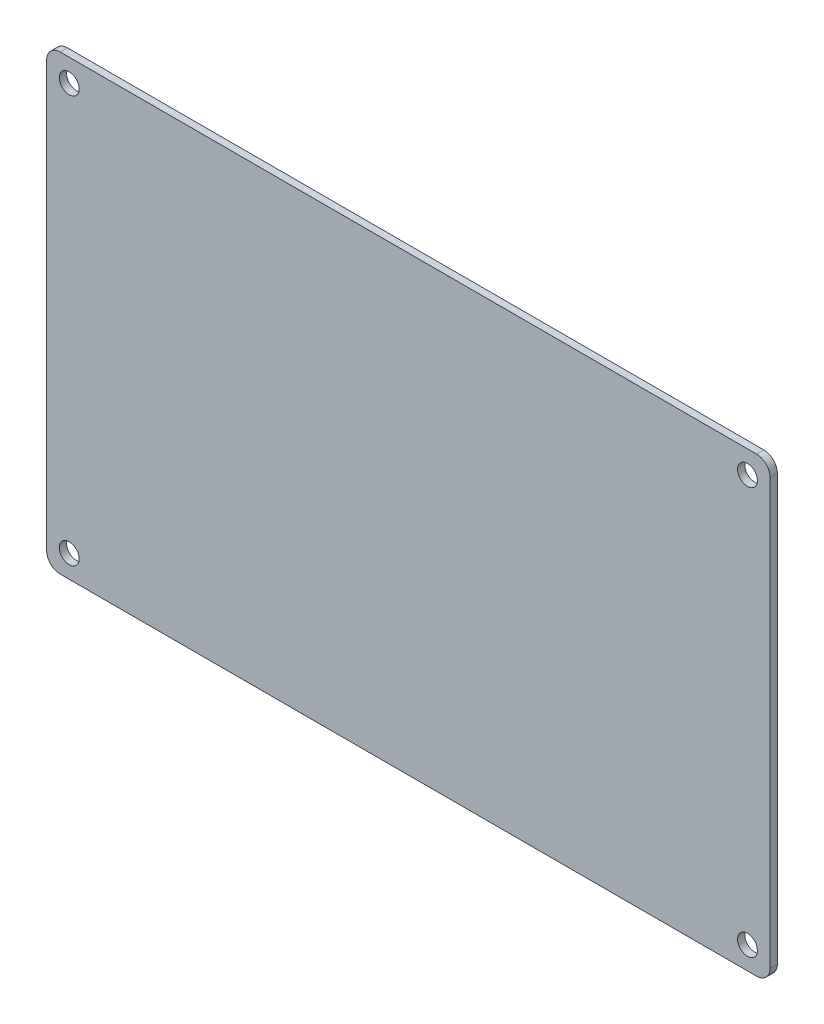
ISO-10303-21;
HEADER;
FILE_DESCRIPTION(('STEP AP214'),'2;1');
FILE_NAME('part.step','',(''),(''),'','','');
FILE_SCHEMA(('AUTOMOTIVE_DESIGN { 1 0 10303 214 1 1 1 1 }'));
ENDSEC;
DATA;
#1=APPLICATION_CONTEXT('core data for automotive mechanical design processes');
#2=APPLICATION_PROTOCOL_DEFINITION('international standard','automotive_design',2000,#1);
#3=PRODUCT_CONTEXT('',#1,'mechanical');
#4=PRODUCT('Part','Part','',(#3));
#5=PRODUCT_RELATED_PRODUCT_CATEGORY('part','',(#4));
#6=PRODUCT_DEFINITION_FORMATION('','',#4);
#7=PRODUCT_DEFINITION_CONTEXT('part definition',#1,'design');
#8=PRODUCT_DEFINITION('design','',#6,#7);
#9=PRODUCT_DEFINITION_SHAPE('','',#8);
#10=(LENGTH_UNIT() NAMED_UNIT(*) SI_UNIT(.MILLI.,.METRE.));
#11=(NAMED_UNIT(*) PLANE_ANGLE_UNIT() SI_UNIT($,.RADIAN.));
#12=(NAMED_UNIT(*) SI_UNIT($,.STERADIAN.) SOLID_ANGLE_UNIT());
#13=UNCERTAINTY_MEASURE_WITH_UNIT(LENGTH_MEASURE(1.E-05),#10,'distance_accuracy_value','');
#14=(GEOMETRIC_REPRESENTATION_CONTEXT(3) GLOBAL_UNCERTAINTY_ASSIGNED_CONTEXT((#13)) GLOBAL_UNIT_ASSIGNED_CONTEXT((#10,
#11,#12)) REPRESENTATION_CONTEXT('',''));
#15=CARTESIAN_POINT('',(0.,0.,0.));
#16=DIRECTION('',(0.,0.,1.));
#17=DIRECTION('',(1.,0.,0.));
#18=AXIS2_PLACEMENT_3D('',#15,#16,#17);
#19=CARTESIAN_POINT('',(-80.,-50.,1.6));
#20=DIRECTION('',(1.,0.,0.));
#21=DIRECTION('',(0.,0.,-1.));
#22=AXIS2_PLACEMENT_3D('',#19,#20,#21);
#23=PLANE('',#22);
#24=DIRECTION('',(0.,-1.,0.));
#25=VECTOR('',#24,1.);
#26=CARTESIAN_POINT('',(-80.,-50.,0.));
#27=LINE('',#26,#25);
#28=CARTESIAN_POINT('',(-80.,47.,0.));
#29=VERTEX_POINT('',#28);
#30=CARTESIAN_POINT('',(-80.,-47.,0.));
#31=VERTEX_POINT('',#30);
#32=EDGE_CURVE('E136',#29,#31,#27,.T.);
#33=ORIENTED_EDGE('',*,*,#32,.T.);
#34=DIRECTION('',(0.,0.,-1.));
#35=VECTOR('',#34,1.);
#36=CARTESIAN_POINT('',(-80.,-47.,1.6));
#37=LINE('',#36,#35);
#38=CARTESIAN_POINT('',(-80.,-47.,1.6));
#39=VERTEX_POINT('',#38);
#40=EDGE_CURVE('E159',#31,#39,#37,.F.);
#41=ORIENTED_EDGE('',*,*,#40,.T.);
#42=DIRECTION('',(0.,-1.,0.));
#43=VECTOR('',#42,1.);
#44=CARTESIAN_POINT('',(-80.,-50.,1.6));
#45=LINE('',#44,#43);
#46=CARTESIAN_POINT('',(-80.,47.,1.6));
#47=VERTEX_POINT('',#46);
#48=EDGE_CURVE('E134',#47,#39,#45,.T.);
#49=ORIENTED_EDGE('',*,*,#48,.F.);
#50=DIRECTION('',(0.,0.,-1.));
#51=VECTOR('',#50,1.);
#52=CARTESIAN_POINT('',(-80.,47.,1.6));
#53=LINE('',#52,#51);
#54=EDGE_CURVE('E156',#47,#29,#53,.T.);
#55=ORIENTED_EDGE('',*,*,#54,.T.);
#56=EDGE_LOOP('',(#33,#41,#49,#55));
#57=FACE_BOUND('',#56,.T.);
#58=ADVANCED_FACE('F39',(#57),#23,.F.);
#59=CARTESIAN_POINT('',(80.,-50.,1.6));
#60=DIRECTION('',(0.,1.,0.));
#61=DIRECTION('',(-1.,0.,0.));
#62=AXIS2_PLACEMENT_3D('',#59,#60,#61);
#63=PLANE('',#62);
#64=DIRECTION('',(1.,0.,0.));
#65=VECTOR('',#64,1.);
#66=CARTESIAN_POINT('',(80.,-50.,0.));
#67=LINE('',#66,#65);
#68=CARTESIAN_POINT('',(-77.,-50.,0.));
#69=VERTEX_POINT('',#68);
#70=CARTESIAN_POINT('',(77.,-50.,0.));
#71=VERTEX_POINT('',#70);
#72=EDGE_CURVE('E132',#69,#71,#67,.T.);
#73=ORIENTED_EDGE('',*,*,#72,.T.);
#74=DIRECTION('',(0.,0.,-1.));
#75=VECTOR('',#74,1.);
#76=CARTESIAN_POINT('',(77.,-50.,1.6));
#77=LINE('',#76,#75);
#78=CARTESIAN_POINT('',(77.,-50.,1.6));
#79=VERTEX_POINT('',#78);
#80=EDGE_CURVE('E111',#71,#79,#77,.F.);
#81=ORIENTED_EDGE('',*,*,#80,.T.);
#82=DIRECTION('',(1.,0.,0.));
#83=VECTOR('',#82,1.);
#84=CARTESIAN_POINT('',(80.,-50.,1.6));
#85=LINE('',#84,#83);
#86=CARTESIAN_POINT('',(-77.,-50.,1.6));
#87=VERTEX_POINT('',#86);
#88=EDGE_CURVE('E180',#87,#79,#85,.T.);
#89=ORIENTED_EDGE('',*,*,#88,.F.);
#90=DIRECTION('',(0.,0.,-1.));
#91=VECTOR('',#90,1.);
#92=CARTESIAN_POINT('',(-77.,-50.,1.6));
#93=LINE('',#92,#91);
#94=EDGE_CURVE('E116',#87,#69,#93,.T.);
#95=ORIENTED_EDGE('',*,*,#94,.T.);
#96=EDGE_LOOP('',(#73,#81,#89,#95));
#97=FACE_BOUND('',#96,.T.);
#98=ADVANCED_FACE('F200',(#97),#63,.F.);
#99=CARTESIAN_POINT('',(80.,-50.,1.6));
#100=DIRECTION('',(-1.,0.,0.));
#101=DIRECTION('',(0.,0.,1.));
#102=AXIS2_PLACEMENT_3D('',#99,#100,#101);
#103=PLANE('',#102);
#104=DIRECTION('',(0.,1.,0.));
#105=VECTOR('',#104,1.);
#106=CARTESIAN_POINT('',(80.,-50.,1.6));
#107=LINE('',#106,#105);
#108=CARTESIAN_POINT('',(80.,-47.,1.6));
#109=VERTEX_POINT('',#108);
#110=CARTESIAN_POINT('',(80.,47.,1.6));
#111=VERTEX_POINT('',#110);
#112=EDGE_CURVE('E125',#109,#111,#107,.T.);
#113=ORIENTED_EDGE('',*,*,#112,.F.);
#114=DIRECTION('',(0.,0.,-1.));
#115=VECTOR('',#114,1.);
#116=CARTESIAN_POINT('',(80.,-47.,1.6));
#117=LINE('',#116,#115);
#118=CARTESIAN_POINT('',(80.,-47.,0.));
#119=VERTEX_POINT('',#118);
#120=EDGE_CURVE('E110',#109,#119,#117,.T.);
#121=ORIENTED_EDGE('',*,*,#120,.T.);
#122=DIRECTION('',(0.,1.,0.));
#123=VECTOR('',#122,1.);
#124=CARTESIAN_POINT('',(80.,-50.,0.));
#125=LINE('',#124,#123);
#126=CARTESIAN_POINT('',(80.,47.,0.));
#127=VERTEX_POINT('',#126);
#128=EDGE_CURVE('E123',#119,#127,#125,.T.);
#129=ORIENTED_EDGE('',*,*,#128,.T.);
#130=DIRECTION('',(0.,0.,-1.));
#131=VECTOR('',#130,1.);
#132=CARTESIAN_POINT('',(80.,47.,1.6));
#133=LINE('',#132,#131);
#134=EDGE_CURVE('E127',#127,#111,#133,.F.);
#135=ORIENTED_EDGE('',*,*,#134,.T.);
#136=EDGE_LOOP('',(#113,#121,#129,#135));
#137=FACE_BOUND('',#136,.T.);
#138=ADVANCED_FACE('F122',(#137),#103,.F.);
#139=CARTESIAN_POINT('',(80.,50.,1.6));
#140=DIRECTION('',(0.,-1.,0.));
#141=DIRECTION('',(1.,0.,0.));
#142=AXIS2_PLACEMENT_3D('',#139,#140,#141);
#143=PLANE('',#142);
#144=DIRECTION('',(-1.,0.,0.));
#145=VECTOR('',#144,1.);
#146=CARTESIAN_POINT('',(80.,50.,0.));
#147=LINE('',#146,#145);
#148=CARTESIAN_POINT('',(77.,50.,0.));
#149=VERTEX_POINT('',#148);
#150=CARTESIAN_POINT('',(-77.,50.,0.));
#151=VERTEX_POINT('',#150);
#152=EDGE_CURVE('E131',#149,#151,#147,.T.);
#153=ORIENTED_EDGE('',*,*,#152,.T.);
#154=DIRECTION('',(0.,0.,-1.));
#155=VECTOR('',#154,1.);
#156=CARTESIAN_POINT('',(-77.,50.,1.6));
#157=LINE('',#156,#155);
#158=CARTESIAN_POINT('',(-77.,50.,1.6));
#159=VERTEX_POINT('',#158);
#160=EDGE_CURVE('E11',#151,#159,#157,.F.);
#161=ORIENTED_EDGE('',*,*,#160,.T.);
#162=DIRECTION('',(-1.,0.,0.));
#163=VECTOR('',#162,1.);
#164=CARTESIAN_POINT('',(80.,50.,1.6));
#165=LINE('',#164,#163);
#166=CARTESIAN_POINT('',(77.,50.,1.6));
#167=VERTEX_POINT('',#166);
#168=EDGE_CURVE('E140',#167,#159,#165,.T.);
#169=ORIENTED_EDGE('',*,*,#168,.F.);
#170=DIRECTION('',(0.,0.,-1.));
#171=VECTOR('',#170,1.);
#172=CARTESIAN_POINT('',(77.,50.,1.6));
#173=LINE('',#172,#171);
#174=EDGE_CURVE('E48',#167,#149,#173,.T.);
#175=ORIENTED_EDGE('',*,*,#174,.T.);
#176=EDGE_LOOP('',(#153,#161,#169,#175));
#177=FACE_BOUND('',#176,.T.);
#178=ADVANCED_FACE('F202',(#177),#143,.F.);
#179=CARTESIAN_POINT('',(0.,0.,1.6));
#180=DIRECTION('',(0.,0.,1.));
#181=DIRECTION('',(1.,0.,0.));
#182=AXIS2_PLACEMENT_3D('',#179,#180,#181);
#183=PLANE('',#182);
#184=CARTESIAN_POINT('',(-75.,-45.,1.6));
#185=DIRECTION('',(0.,0.,1.));
#186=DIRECTION('',(1.,0.,0.));
#187=AXIS2_PLACEMENT_3D('',#184,#185,#186);
#188=CIRCLE('',#187,2.19999999999999);
#189=CARTESIAN_POINT('',(-72.8,-45.,1.6));
#190=VERTEX_POINT('',#189);
#191=EDGE_CURVE('E261',#190,#190,#188,.T.);
#192=ORIENTED_EDGE('',*,*,#191,.F.);
#193=EDGE_LOOP('',(#192));
#194=FACE_BOUND('',#193,.T.);
#195=CARTESIAN_POINT('',(-75.,45.,1.6));
#196=DIRECTION('',(0.,0.,1.));
#197=DIRECTION('',(1.,0.,0.));
#198=AXIS2_PLACEMENT_3D('',#195,#196,#197);
#199=CIRCLE('',#198,2.19999999999999);
#200=CARTESIAN_POINT('',(-72.8,45.,1.6));
#201=VERTEX_POINT('',#200);
#202=EDGE_CURVE('E255',#201,#201,#199,.T.);
#203=ORIENTED_EDGE('',*,*,#202,.F.);
#204=EDGE_LOOP('',(#203));
#205=FACE_BOUND('',#204,.T.);
#206=CARTESIAN_POINT('',(75.,45.,1.6));
#207=DIRECTION('',(0.,0.,1.));
#208=DIRECTION('',(1.,0.,0.));
#209=AXIS2_PLACEMENT_3D('',#206,#207,#208);
#210=CIRCLE('',#209,2.19999999999999);
#211=CARTESIAN_POINT('',(77.2,45.,1.6));
#212=VERTEX_POINT('',#211);
#213=EDGE_CURVE('E174',#212,#212,#210,.T.);
#214=ORIENTED_EDGE('',*,*,#213,.F.);
#215=EDGE_LOOP('',(#214));
#216=FACE_BOUND('',#215,.T.);
#217=CARTESIAN_POINT('',(75.,-45.,1.6));
#218=DIRECTION('',(0.,0.,1.));
#219=DIRECTION('',(1.,0.,0.));
#220=AXIS2_PLACEMENT_3D('',#217,#218,#219);
#221=CIRCLE('',#220,2.19999999999999);
#222=CARTESIAN_POINT('',(77.2,-45.,1.6));
#223=VERTEX_POINT('',#222);
#224=EDGE_CURVE('E164',#223,#223,#221,.T.);
#225=ORIENTED_EDGE('',*,*,#224,.F.);
#226=EDGE_LOOP('',(#225));
#227=FACE_BOUND('',#226,.T.);
#228=ORIENTED_EDGE('',*,*,#88,.T.);
#229=CARTESIAN_POINT('',(77.,-47.,1.6));
#230=DIRECTION('',(0.,0.,1.));
#231=DIRECTION('',(1.,0.,0.));
#232=AXIS2_PLACEMENT_3D('',#229,#230,#231);
#233=CIRCLE('',#232,3.);
#234=EDGE_CURVE('E154',#79,#109,#233,.T.);
#235=ORIENTED_EDGE('',*,*,#234,.T.);
#236=ORIENTED_EDGE('',*,*,#112,.T.);
#237=CARTESIAN_POINT('',(77.,47.,1.6));
#238=DIRECTION('',(0.,0.,1.));
#239=DIRECTION('',(1.,0.,0.));
#240=AXIS2_PLACEMENT_3D('',#237,#238,#239);
#241=CIRCLE('',#240,3.);
#242=EDGE_CURVE('E61',#111,#167,#241,.T.);
#243=ORIENTED_EDGE('',*,*,#242,.T.);
#244=ORIENTED_EDGE('',*,*,#168,.T.);
#245=CARTESIAN_POINT('',(-77.,47.,1.6));
#246=DIRECTION('',(0.,0.,1.));
#247=DIRECTION('',(1.,0.,0.));
#248=AXIS2_PLACEMENT_3D('',#245,#246,#247);
#249=CIRCLE('',#248,3.);
#250=EDGE_CURVE('E150',#159,#47,#249,.T.);
#251=ORIENTED_EDGE('',*,*,#250,.T.);
#252=ORIENTED_EDGE('',*,*,#48,.T.);
#253=CARTESIAN_POINT('',(-77.,-47.,1.6));
#254=DIRECTION('',(0.,0.,1.));
#255=DIRECTION('',(1.,0.,0.));
#256=AXIS2_PLACEMENT_3D('',#253,#254,#255);
#257=CIRCLE('',#256,3.);
#258=EDGE_CURVE('E152',#39,#87,#257,.T.);
#259=ORIENTED_EDGE('',*,*,#258,.T.);
#260=EDGE_LOOP('',(#228,#235,#236,#243,#244,#251,#252,#259));
#261=FACE_BOUND('',#260,.T.);
#262=ADVANCED_FACE('F185',(#194,#205,#216,#227,#261),#183,.T.);
#263=CARTESIAN_POINT('',(0.,0.,0.));
#264=DIRECTION('',(0.,0.,1.));
#265=DIRECTION('',(1.,0.,0.));
#266=AXIS2_PLACEMENT_3D('',#263,#264,#265);
#267=PLANE('',#266);
#268=CARTESIAN_POINT('',(-75.,-45.,0.));
#269=DIRECTION('',(0.,0.,1.));
#270=DIRECTION('',(1.,0.,0.));
#271=AXIS2_PLACEMENT_3D('',#268,#269,#270);
#272=CIRCLE('',#271,2.19999999999999);
#273=CARTESIAN_POINT('',(-72.8,-45.,0.));
#274=VERTEX_POINT('',#273);
#275=EDGE_CURVE('E43',#274,#274,#272,.T.);
#276=ORIENTED_EDGE('',*,*,#275,.T.);
#277=EDGE_LOOP('',(#276));
#278=FACE_BOUND('',#277,.T.);
#279=CARTESIAN_POINT('',(-75.,45.,0.));
#280=DIRECTION('',(0.,0.,1.));
#281=DIRECTION('',(1.,0.,0.));
#282=AXIS2_PLACEMENT_3D('',#279,#280,#281);
#283=CIRCLE('',#282,2.19999999999999);
#284=CARTESIAN_POINT('',(-72.8,45.,0.));
#285=VERTEX_POINT('',#284);
#286=EDGE_CURVE('E251',#285,#285,#283,.T.);
#287=ORIENTED_EDGE('',*,*,#286,.T.);
#288=EDGE_LOOP('',(#287));
#289=FACE_BOUND('',#288,.T.);
#290=CARTESIAN_POINT('',(75.,45.,0.));
#291=DIRECTION('',(0.,0.,1.));
#292=DIRECTION('',(1.,0.,0.));
#293=AXIS2_PLACEMENT_3D('',#290,#291,#292);
#294=CIRCLE('',#293,2.19999999999999);
#295=CARTESIAN_POINT('',(77.2,45.,0.));
#296=VERTEX_POINT('',#295);
#297=EDGE_CURVE('E169',#296,#296,#294,.T.);
#298=ORIENTED_EDGE('',*,*,#297,.T.);
#299=EDGE_LOOP('',(#298));
#300=FACE_BOUND('',#299,.T.);
#301=CARTESIAN_POINT('',(75.,-45.,0.));
#302=DIRECTION('',(0.,0.,1.));
#303=DIRECTION('',(1.,0.,0.));
#304=AXIS2_PLACEMENT_3D('',#301,#302,#303);
#305=CIRCLE('',#304,2.19999999999999);
#306=CARTESIAN_POINT('',(77.2,-45.,0.));
#307=VERTEX_POINT('',#306);
#308=EDGE_CURVE('E162',#307,#307,#305,.T.);
#309=ORIENTED_EDGE('',*,*,#308,.T.);
#310=EDGE_LOOP('',(#309));
#311=FACE_BOUND('',#310,.T.);
#312=ORIENTED_EDGE('',*,*,#128,.F.);
#313=CARTESIAN_POINT('',(77.,-47.,0.));
#314=DIRECTION('',(0.,0.,1.));
#315=DIRECTION('',(1.,0.,0.));
#316=AXIS2_PLACEMENT_3D('',#313,#314,#315);
#317=CIRCLE('',#316,3.);
#318=EDGE_CURVE('E106',#119,#71,#317,.F.);
#319=ORIENTED_EDGE('',*,*,#318,.T.);
#320=ORIENTED_EDGE('',*,*,#72,.F.);
#321=CARTESIAN_POINT('',(-77.,-47.,0.));
#322=DIRECTION('',(0.,0.,1.));
#323=DIRECTION('',(1.,0.,0.));
#324=AXIS2_PLACEMENT_3D('',#321,#322,#323);
#325=CIRCLE('',#324,3.);
#326=EDGE_CURVE('E117',#69,#31,#325,.F.);
#327=ORIENTED_EDGE('',*,*,#326,.T.);
#328=ORIENTED_EDGE('',*,*,#32,.F.);
#329=CARTESIAN_POINT('',(-77.,47.,0.));
#330=DIRECTION('',(0.,0.,1.));
#331=DIRECTION('',(1.,0.,0.));
#332=AXIS2_PLACEMENT_3D('',#329,#330,#331);
#333=CIRCLE('',#332,3.);
#334=EDGE_CURVE('E143',#29,#151,#333,.F.);
#335=ORIENTED_EDGE('',*,*,#334,.T.);
#336=ORIENTED_EDGE('',*,*,#152,.F.);
#337=CARTESIAN_POINT('',(77.,47.,0.));
#338=DIRECTION('',(0.,0.,1.));
#339=DIRECTION('',(1.,0.,0.));
#340=AXIS2_PLACEMENT_3D('',#337,#338,#339);
#341=CIRCLE('',#340,3.);
#342=EDGE_CURVE('E126',#149,#127,#341,.F.);
#343=ORIENTED_EDGE('',*,*,#342,.T.);
#344=EDGE_LOOP('',(#312,#319,#320,#327,#328,#335,#336,#343));
#345=FACE_BOUND('',#344,.T.);
#346=ADVANCED_FACE('F129',(#278,#289,#300,#311,#345),#267,.F.);
#347=CARTESIAN_POINT('',(77.,-47.,1.6));
#348=DIRECTION('',(0.,0.,-1.));
#349=DIRECTION('',(-1.,0.,0.));
#350=AXIS2_PLACEMENT_3D('',#347,#348,#349);
#351=CYLINDRICAL_SURFACE('',#350,3.);
#352=ORIENTED_EDGE('',*,*,#234,.F.);
#353=ORIENTED_EDGE('',*,*,#80,.F.);
#354=ORIENTED_EDGE('',*,*,#318,.F.);
#355=ORIENTED_EDGE('',*,*,#120,.F.);
#356=EDGE_LOOP('',(#352,#353,#354,#355));
#357=FACE_BOUND('',#356,.T.);
#358=ADVANCED_FACE('F109',(#357),#351,.T.);
#359=CARTESIAN_POINT('',(-77.,-47.,1.6));
#360=DIRECTION('',(0.,0.,-1.));
#361=DIRECTION('',(-1.,0.,0.));
#362=AXIS2_PLACEMENT_3D('',#359,#360,#361);
#363=CYLINDRICAL_SURFACE('',#362,3.);
#364=ORIENTED_EDGE('',*,*,#258,.F.);
#365=ORIENTED_EDGE('',*,*,#40,.F.);
#366=ORIENTED_EDGE('',*,*,#326,.F.);
#367=ORIENTED_EDGE('',*,*,#94,.F.);
#368=EDGE_LOOP('',(#364,#365,#366,#367));
#369=FACE_BOUND('',#368,.T.);
#370=ADVANCED_FACE('F197',(#369),#363,.T.);
#371=CARTESIAN_POINT('',(-77.,47.,1.6));
#372=DIRECTION('',(0.,0.,-1.));
#373=DIRECTION('',(-1.,0.,0.));
#374=AXIS2_PLACEMENT_3D('',#371,#372,#373);
#375=CYLINDRICAL_SURFACE('',#374,3.);
#376=ORIENTED_EDGE('',*,*,#250,.F.);
#377=ORIENTED_EDGE('',*,*,#160,.F.);
#378=ORIENTED_EDGE('',*,*,#334,.F.);
#379=ORIENTED_EDGE('',*,*,#54,.F.);
#380=EDGE_LOOP('',(#376,#377,#378,#379));
#381=FACE_BOUND('',#380,.T.);
#382=ADVANCED_FACE('F190',(#381),#375,.T.);
#383=CARTESIAN_POINT('',(77.,47.,1.6));
#384=DIRECTION('',(0.,0.,-1.));
#385=DIRECTION('',(-1.,0.,0.));
#386=AXIS2_PLACEMENT_3D('',#383,#384,#385);
#387=CYLINDRICAL_SURFACE('',#386,3.);
#388=ORIENTED_EDGE('',*,*,#242,.F.);
#389=ORIENTED_EDGE('',*,*,#134,.F.);
#390=ORIENTED_EDGE('',*,*,#342,.F.);
#391=ORIENTED_EDGE('',*,*,#174,.F.);
#392=EDGE_LOOP('',(#388,#389,#390,#391));
#393=FACE_BOUND('',#392,.T.);
#394=ADVANCED_FACE('F41',(#393),#387,.T.);
#395=CARTESIAN_POINT('',(75.,-45.,1.6));
#396=DIRECTION('',(0.,0.,1.));
#397=DIRECTION('',(1.,0.,0.));
#398=AXIS2_PLACEMENT_3D('',#395,#396,#397);
#399=CYLINDRICAL_SURFACE('',#398,2.19999999999999);
#400=ORIENTED_EDGE('',*,*,#224,.T.);
#401=EDGE_LOOP('',(#400));
#402=FACE_BOUND('',#401,.T.);
#403=ORIENTED_EDGE('',*,*,#308,.F.);
#404=EDGE_LOOP('',(#403));
#405=FACE_BOUND('',#404,.T.);
#406=ADVANCED_FACE('F227',(#402,#405),#399,.F.);
#407=CARTESIAN_POINT('',(75.,45.,1.6));
#408=DIRECTION('',(0.,0.,1.));
#409=DIRECTION('',(1.,0.,0.));
#410=AXIS2_PLACEMENT_3D('',#407,#408,#409);
#411=CYLINDRICAL_SURFACE('',#410,2.19999999999999);
#412=ORIENTED_EDGE('',*,*,#213,.T.);
#413=EDGE_LOOP('',(#412));
#414=FACE_BOUND('',#413,.T.);
#415=ORIENTED_EDGE('',*,*,#297,.F.);
#416=EDGE_LOOP('',(#415));
#417=FACE_BOUND('',#416,.T.);
#418=ADVANCED_FACE('F231',(#414,#417),#411,.F.);
#419=CARTESIAN_POINT('',(-75.,45.,1.6));
#420=DIRECTION('',(0.,0.,1.));
#421=DIRECTION('',(1.,0.,0.));
#422=AXIS2_PLACEMENT_3D('',#419,#420,#421);
#423=CYLINDRICAL_SURFACE('',#422,2.19999999999999);
#424=ORIENTED_EDGE('',*,*,#202,.T.);
#425=EDGE_LOOP('',(#424));
#426=FACE_BOUND('',#425,.T.);
#427=ORIENTED_EDGE('',*,*,#286,.F.);
#428=EDGE_LOOP('',(#427));
#429=FACE_BOUND('',#428,.T.);
#430=ADVANCED_FACE('F237',(#426,#429),#423,.F.);
#431=CARTESIAN_POINT('',(-75.,-45.,1.6));
#432=DIRECTION('',(0.,0.,1.));
#433=DIRECTION('',(1.,0.,0.));
#434=AXIS2_PLACEMENT_3D('',#431,#432,#433);
#435=CYLINDRICAL_SURFACE('',#434,2.19999999999999);
#436=ORIENTED_EDGE('',*,*,#191,.T.);
#437=EDGE_LOOP('',(#436));
#438=FACE_BOUND('',#437,.T.);
#439=ORIENTED_EDGE('',*,*,#275,.F.);
#440=EDGE_LOOP('',(#439));
#441=FACE_BOUND('',#440,.T.);
#442=ADVANCED_FACE('F265',(#438,#441),#435,.F.);
#443=CLOSED_SHELL('',(#58,#98,#138,#178,#262,#346,#358,#370,#382,#394,#406,#418,#430,#442));
#444=MANIFOLD_SOLID_BREP('B2',#443);
#445=ADVANCED_BREP_SHAPE_REPRESENTATION('',(#18,#444),#14);
#446=SHAPE_DEFINITION_REPRESENTATION(#9,#445);
ENDSEC;
END-ISO-10303-21;
